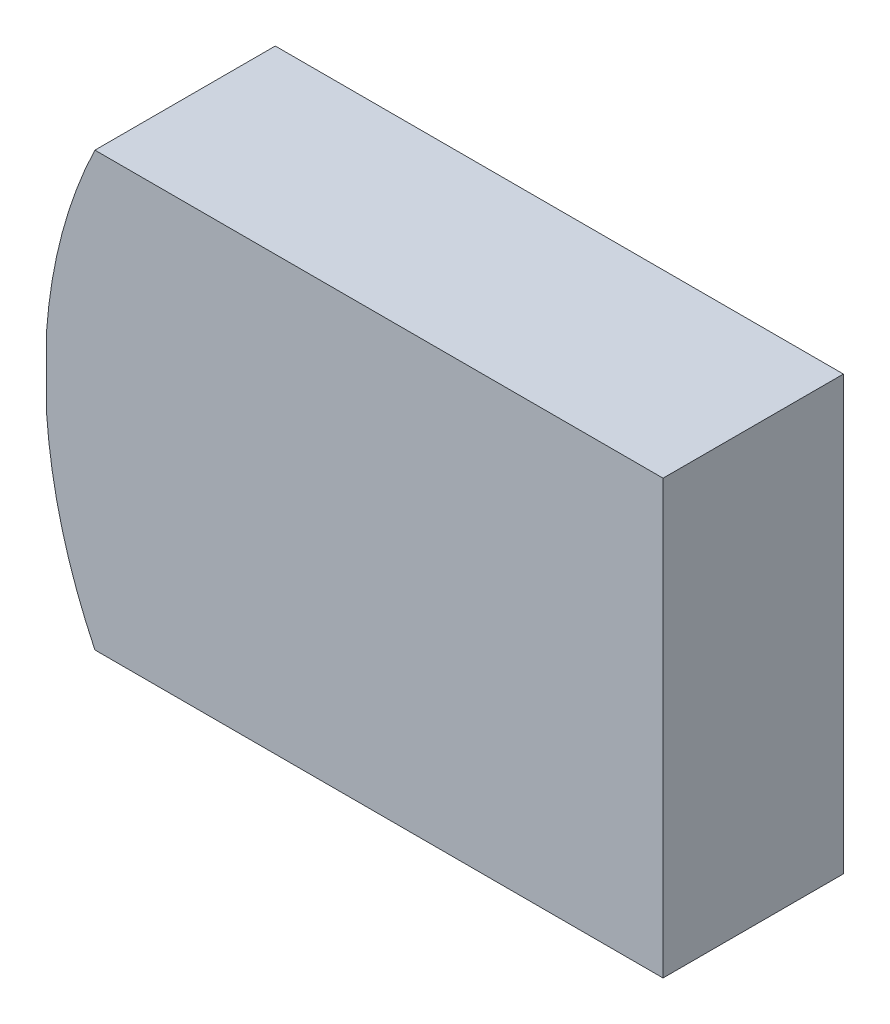
ISO-10303-21;
HEADER;
FILE_DESCRIPTION(('STEP AP214'),'2;1');
FILE_NAME('part.step','',(''),(''),'','','');
FILE_SCHEMA(('AUTOMOTIVE_DESIGN { 1 0 10303 214 1 1 1 1 }'));
ENDSEC;
DATA;
#1=APPLICATION_CONTEXT('core data for automotive mechanical design processes');
#2=APPLICATION_PROTOCOL_DEFINITION('international standard','automotive_design',2000,#1);
#3=PRODUCT_CONTEXT('',#1,'mechanical');
#4=PRODUCT('Part','Part','',(#3));
#5=PRODUCT_RELATED_PRODUCT_CATEGORY('part','',(#4));
#6=PRODUCT_DEFINITION_FORMATION('','',#4);
#7=PRODUCT_DEFINITION_CONTEXT('part definition',#1,'design');
#8=PRODUCT_DEFINITION('design','',#6,#7);
#9=PRODUCT_DEFINITION_SHAPE('','',#8);
#10=(LENGTH_UNIT() NAMED_UNIT(*) SI_UNIT(.MILLI.,.METRE.));
#11=(NAMED_UNIT(*) PLANE_ANGLE_UNIT() SI_UNIT($,.RADIAN.));
#12=(NAMED_UNIT(*) SI_UNIT($,.STERADIAN.) SOLID_ANGLE_UNIT());
#13=UNCERTAINTY_MEASURE_WITH_UNIT(LENGTH_MEASURE(1.E-05),#10,'distance_accuracy_value','');
#14=(GEOMETRIC_REPRESENTATION_CONTEXT(3) GLOBAL_UNCERTAINTY_ASSIGNED_CONTEXT((#13)) GLOBAL_UNIT_ASSIGNED_CONTEXT((#10,
#11,#12)) REPRESENTATION_CONTEXT('',''));
#15=CARTESIAN_POINT('',(0.,0.,0.));
#16=DIRECTION('',(0.,0.,1.));
#17=DIRECTION('',(1.,0.,0.));
#18=AXIS2_PLACEMENT_3D('',#15,#16,#17);
#19=CARTESIAN_POINT('',(59.1444816214174,40.260861330669,1.74752));
#20=DIRECTION('',(0.,0.,1.));
#21=DIRECTION('',(1.,0.,0.));
#22=AXIS2_PLACEMENT_3D('',#19,#20,#21);
#23=PLANE('',#22);
#24=CARTESIAN_POINT('',(62.0065295777774,41.5288492598646,1.74752));
#25=DIRECTION('',(0.,0.,1.));
#26=DIRECTION('',(1.,0.,0.));
#27=AXIS2_PLACEMENT_3D('',#24,#25,#26);
#28=CIRCLE('',#27,2.79976906135998);
#29=CARTESIAN_POINT('',(59.4861935808961,42.7481167693853,1.74752));
#30=VERTEX_POINT('',#29);
#31=CARTESIAN_POINT('',(59.2139347970904,41.7291520001528,1.74752));
#32=VERTEX_POINT('',#31);
#33=EDGE_CURVE('E20',#30,#32,#28,.T.);
#34=ORIENTED_EDGE('',*,*,#33,.T.);
#35=DIRECTION('',(0.,-1.,0.));
#36=VECTOR('',#35,1.);
#37=CARTESIAN_POINT('',(59.2139347970904,41.5288492598773,1.74752));
#38=LINE('',#37,#36);
#39=CARTESIAN_POINT('',(59.2139333707259,41.328586449391,1.74752));
#40=VERTEX_POINT('',#39);
#41=EDGE_CURVE('E97',#32,#40,#38,.T.);
#42=ORIENTED_EDGE('',*,*,#41,.T.);
#43=CARTESIAN_POINT('',(62.0065295777774,41.5288492598646,1.74752));
#44=DIRECTION('',(0.,0.,1.));
#45=DIRECTION('',(1.,0.,0.));
#46=AXIS2_PLACEMENT_3D('',#43,#44,#45);
#47=CIRCLE('',#46,2.79976906135998);
#48=CARTESIAN_POINT('',(59.4861282665355,40.3097167702687,1.74752));
#49=VERTEX_POINT('',#48);
#50=EDGE_CURVE('E86',#40,#49,#47,.T.);
#51=ORIENTED_EDGE('',*,*,#50,.T.);
#52=DIRECTION('',(-0.999999999641262,2.67857448111223E-05,0.));
#53=VECTOR('',#52,1.);
#54=CARTESIAN_POINT('',(61.0863282659739,40.3096739077198,1.74752));
#55=LINE('',#54,#53);
#56=CARTESIAN_POINT('',(62.6865282653993,40.3096310451709,1.74752));
#57=VERTEX_POINT('',#56);
#58=EDGE_CURVE('E82',#49,#57,#55,.F.);
#59=ORIENTED_EDGE('',*,*,#58,.T.);
#60=DIRECTION('',(-2.67857471898582E-05,-0.999999999641262,0.));
#61=VECTOR('',#60,1.);
#62=CARTESIAN_POINT('',(62.6865609225761,41.5288310447245,1.74752));
#63=LINE('',#62,#61);
#64=CARTESIAN_POINT('',(62.6865935797698,42.7480310442813,1.74752));
#65=VERTEX_POINT('',#64);
#66=EDGE_CURVE('E73',#57,#65,#63,.F.);
#67=ORIENTED_EDGE('',*,*,#66,.T.);
#68=DIRECTION('',(0.999999999641262,-2.67857448088332E-05,0.));
#69=VECTOR('',#68,1.);
#70=CARTESIAN_POINT('',(61.086393580334,42.7480739068308,1.74752));
#71=LINE('',#70,#69);
#72=EDGE_CURVE('E64',#65,#30,#71,.F.);
#73=ORIENTED_EDGE('',*,*,#72,.T.);
#74=EDGE_LOOP('',(#34,#42,#51,#59,#67,#73));
#75=FACE_BOUND('',#74,.T.);
#76=ADVANCED_FACE('F16',(#75),#23,.T.);
#77=CARTESIAN_POINT('',(62.6865269591058,40.260863045169,0.7112));
#78=DIRECTION('',(0.999999999641262,-2.67857471898582E-05,0.));
#79=DIRECTION('',(2.67857471898582E-05,0.999999999641262,0.));
#80=AXIS2_PLACEMENT_3D('',#77,#78,#79);
#81=PLANE('',#80);
#82=DIRECTION('',(2.67857471898582E-05,0.999999999641262,0.));
#83=VECTOR('',#82,1.);
#84=CARTESIAN_POINT('',(62.6865269591058,40.260863045169,0.73152));
#85=LINE('',#84,#83);
#86=CARTESIAN_POINT('',(62.6865282653978,40.3096310451709,0.73152));
#87=VERTEX_POINT('',#86);
#88=CARTESIAN_POINT('',(62.6865935797672,42.748031044282,0.73152));
#89=VERTEX_POINT('',#88);
#90=EDGE_CURVE('E112',#87,#89,#85,.T.);
#91=ORIENTED_EDGE('',*,*,#90,.T.);
#92=DIRECTION('',(0.,0.,-1.));
#93=VECTOR('',#92,1.);
#94=CARTESIAN_POINT('',(62.6865935797752,42.748031044282,1.23952));
#95=LINE('',#94,#93);
#96=EDGE_CURVE('E78',#89,#65,#95,.F.);
#97=ORIENTED_EDGE('',*,*,#96,.T.);
#98=ORIENTED_EDGE('',*,*,#66,.F.);
#99=DIRECTION('',(0.,0.,1.));
#100=VECTOR('',#99,1.);
#101=CARTESIAN_POINT('',(62.6865282654024,40.3096310451709,1.23952));
#102=LINE('',#101,#100);
#103=EDGE_CURVE('E77',#57,#87,#102,.F.);
#104=ORIENTED_EDGE('',*,*,#103,.T.);
#105=EDGE_LOOP('',(#91,#97,#98,#104));
#106=FACE_BOUND('',#105,.T.);
#107=ADVANCED_FACE('F76',(#106),#81,.T.);
#108=CARTESIAN_POINT('',(62.7506015797498,42.74802932978,0.7112));
#109=DIRECTION('',(2.67857448088332E-05,0.999999999641262,0.));
#110=DIRECTION('',(-0.999999999641262,2.67857448088332E-05,0.));
#111=AXIS2_PLACEMENT_3D('',#108,#109,#110);
#112=PLANE('',#111);
#113=DIRECTION('',(-0.999999999641262,2.67857448088332E-05,0.));
#114=VECTOR('',#113,1.);
#115=CARTESIAN_POINT('',(62.7506015797498,42.74802932978,0.73152));
#116=LINE('',#115,#114);
#117=CARTESIAN_POINT('',(59.4861935808961,42.7481167693853,0.73152));
#118=VERTEX_POINT('',#117);
#119=EDGE_CURVE('E109',#89,#118,#116,.T.);
#120=ORIENTED_EDGE('',*,*,#119,.T.);
#121=DIRECTION('',(0.,0.,1.));
#122=VECTOR('',#121,1.);
#123=CARTESIAN_POINT('',(59.4861935808988,42.7481167693909,1.23952));
#124=LINE('',#123,#122);
#125=EDGE_CURVE('E123',#118,#30,#124,.T.);
#126=ORIENTED_EDGE('',*,*,#125,.T.);
#127=ORIENTED_EDGE('',*,*,#72,.F.);
#128=ORIENTED_EDGE('',*,*,#96,.F.);
#129=EDGE_LOOP('',(#120,#126,#127,#128));
#130=FACE_BOUND('',#129,.T.);
#131=ADVANCED_FACE('F135',(#130),#112,.T.);
#132=CARTESIAN_POINT('',(62.0065295777774,41.5288492598646,0.73152));
#133=DIRECTION('',(0.,0.,1.));
#134=DIRECTION('',(1.,0.,0.));
#135=AXIS2_PLACEMENT_3D('',#132,#133,#134);
#136=CYLINDRICAL_SURFACE('',#135,2.79976906135998);
#137=ORIENTED_EDGE('',*,*,#125,.F.);
#138=CARTESIAN_POINT('',(62.0065295777774,41.5288492598646,0.73152));
#139=DIRECTION('',(0.,0.,1.));
#140=DIRECTION('',(1.,0.,0.));
#141=AXIS2_PLACEMENT_3D('',#138,#139,#140);
#142=CIRCLE('',#141,2.79976906135998);
#143=CARTESIAN_POINT('',(59.2139347970904,41.7291520001528,0.73152));
#144=VERTEX_POINT('',#143);
#145=EDGE_CURVE('E106',#118,#144,#142,.T.);
#146=ORIENTED_EDGE('',*,*,#145,.T.);
#147=DIRECTION('',(0.,0.,1.));
#148=VECTOR('',#147,1.);
#149=CARTESIAN_POINT('',(59.2139347970904,41.729152,1.23952));
#150=LINE('',#149,#148);
#151=EDGE_CURVE('E99',#144,#32,#150,.T.);
#152=ORIENTED_EDGE('',*,*,#151,.T.);
#153=ORIENTED_EDGE('',*,*,#33,.F.);
#154=EDGE_LOOP('',(#137,#146,#152,#153));
#155=FACE_BOUND('',#154,.T.);
#156=ADVANCED_FACE('F130',(#155),#136,.T.);
#157=CARTESIAN_POINT('',(59.2139347970904,41.3205344101502,0.7112));
#158=DIRECTION('',(1.,0.,0.));
#159=DIRECTION('',(0.,1.,0.));
#160=AXIS2_PLACEMENT_3D('',#157,#158,#159);
#161=PLANE('',#160);
#162=ORIENTED_EDGE('',*,*,#41,.F.);
#163=ORIENTED_EDGE('',*,*,#151,.F.);
#164=DIRECTION('',(0.,-1.,0.));
#165=VECTOR('',#164,1.);
#166=CARTESIAN_POINT('',(59.2139347970904,41.5288739072753,0.73152));
#167=LINE('',#166,#165);
#168=CARTESIAN_POINT('',(59.2139326575437,41.3285862957701,0.73152));
#169=VERTEX_POINT('',#168);
#170=EDGE_CURVE('E105',#144,#169,#167,.T.);
#171=ORIENTED_EDGE('',*,*,#170,.T.);
#172=DIRECTION('',(0.,0.,1.));
#173=VECTOR('',#172,1.);
#174=CARTESIAN_POINT('',(59.2139319443614,41.3285862957701,1.23952));
#175=LINE('',#174,#173);
#176=EDGE_CURVE('E88',#169,#40,#175,.T.);
#177=ORIENTED_EDGE('',*,*,#176,.T.);
#178=EDGE_LOOP('',(#162,#163,#171,#177));
#179=FACE_BOUND('',#178,.T.);
#180=ADVANCED_FACE('F127',(#179),#161,.F.);
#181=CARTESIAN_POINT('',(62.0065295777774,41.5288492598646,0.73152));
#182=DIRECTION('',(0.,0.,1.));
#183=DIRECTION('',(1.,0.,0.));
#184=AXIS2_PLACEMENT_3D('',#181,#182,#183);
#185=CYLINDRICAL_SURFACE('',#184,2.79976906135998);
#186=DIRECTION('',(0.,0.,-1.));
#187=VECTOR('',#186,1.);
#188=CARTESIAN_POINT('',(59.4861282665454,40.3097167702687,1.23952));
#189=LINE('',#188,#187);
#190=CARTESIAN_POINT('',(59.4861282665355,40.3097167702687,0.73152));
#191=VERTEX_POINT('',#190);
#192=EDGE_CURVE('E34',#191,#49,#189,.F.);
#193=ORIENTED_EDGE('',*,*,#192,.T.);
#194=ORIENTED_EDGE('',*,*,#50,.F.);
#195=ORIENTED_EDGE('',*,*,#176,.F.);
#196=CARTESIAN_POINT('',(62.0065295777774,41.5288492598646,0.73152));
#197=DIRECTION('',(0.,0.,1.));
#198=DIRECTION('',(1.,0.,0.));
#199=AXIS2_PLACEMENT_3D('',#196,#197,#198);
#200=CIRCLE('',#199,2.79976906135998);
#201=EDGE_CURVE('E26',#169,#191,#200,.T.);
#202=ORIENTED_EDGE('',*,*,#201,.T.);
#203=EDGE_LOOP('',(#193,#194,#195,#202));
#204=FACE_BOUND('',#203,.T.);
#205=ADVANCED_FACE('F154',(#204),#185,.T.);
#206=CARTESIAN_POINT('',(59.4221202665708,40.3097184847706,0.7112));
#207=DIRECTION('',(-2.67857448090376E-05,-0.999999999641262,0.));
#208=DIRECTION('',(0.999999999641262,-2.67857448090376E-05,0.));
#209=AXIS2_PLACEMENT_3D('',#206,#207,#208);
#210=PLANE('',#209);
#211=DIRECTION('',(0.999999999641262,-2.67857448090376E-05,0.));
#212=VECTOR('',#211,1.);
#213=CARTESIAN_POINT('',(59.4221202665708,40.3097184847706,0.73152));
#214=LINE('',#213,#212);
#215=EDGE_CURVE('E11',#191,#87,#214,.T.);
#216=ORIENTED_EDGE('',*,*,#215,.T.);
#217=ORIENTED_EDGE('',*,*,#103,.F.);
#218=ORIENTED_EDGE('',*,*,#58,.F.);
#219=ORIENTED_EDGE('',*,*,#192,.F.);
#220=EDGE_LOOP('',(#216,#217,#218,#219));
#221=FACE_BOUND('',#220,.T.);
#222=ADVANCED_FACE('F81',(#221),#210,.T.);
#223=CARTESIAN_POINT('',(59.1444816214174,40.260861330669,0.73152));
#224=DIRECTION('',(0.,0.,1.));
#225=DIRECTION('',(1.,0.,0.));
#226=AXIS2_PLACEMENT_3D('',#223,#224,#225);
#227=PLANE('',#226);
#228=ORIENTED_EDGE('',*,*,#201,.F.);
#229=ORIENTED_EDGE('',*,*,#170,.F.);
#230=ORIENTED_EDGE('',*,*,#145,.F.);
#231=ORIENTED_EDGE('',*,*,#119,.F.);
#232=ORIENTED_EDGE('',*,*,#90,.F.);
#233=ORIENTED_EDGE('',*,*,#215,.F.);
#234=EDGE_LOOP('',(#228,#229,#230,#231,#232,#233));
#235=FACE_BOUND('',#234,.T.);
#236=ADVANCED_FACE('F18',(#235),#227,.F.);
#237=CLOSED_SHELL('',(#76,#107,#131,#156,#180,#205,#222,#236));
#238=MANIFOLD_SOLID_BREP('B1',#237);
#239=ADVANCED_BREP_SHAPE_REPRESENTATION('',(#18,#238),#14);
#240=SHAPE_DEFINITION_REPRESENTATION(#9,#239);
ENDSEC;
END-ISO-10303-21;
